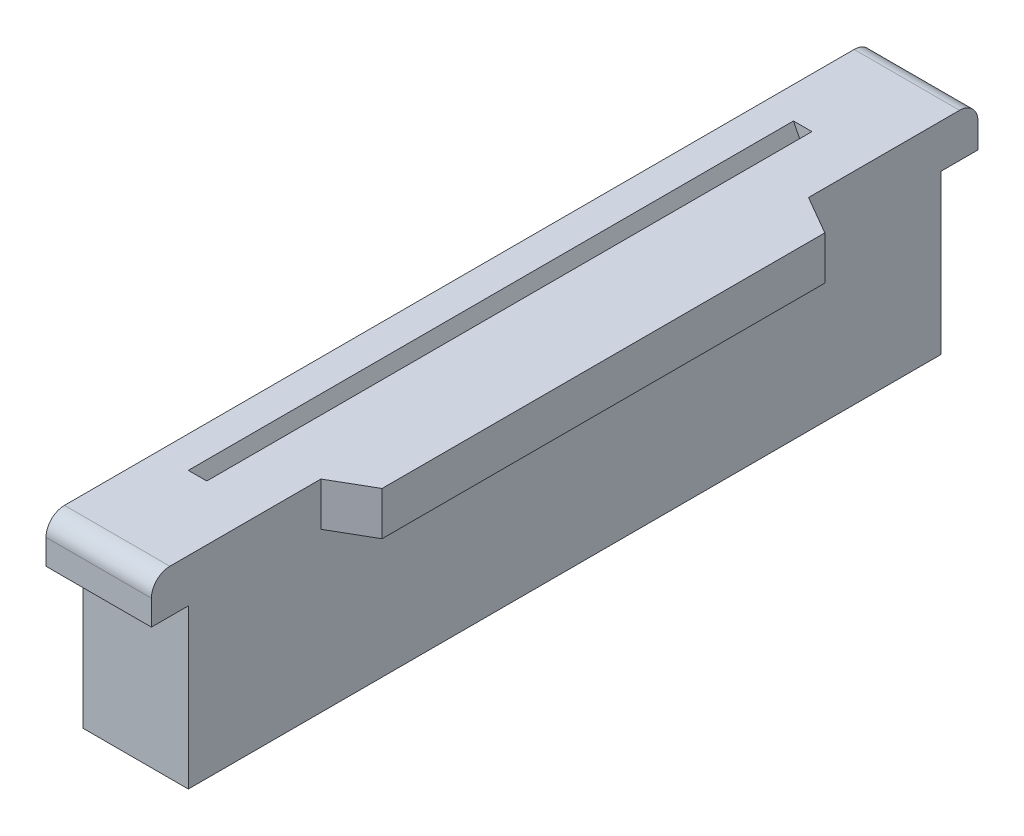
ISO-10303-21;
HEADER;
FILE_DESCRIPTION(('STEP AP214'),'2;1');
FILE_NAME('part.step','',(''),(''),'','','');
FILE_SCHEMA(('AUTOMOTIVE_DESIGN { 1 0 10303 214 1 1 1 1 }'));
ENDSEC;
DATA;
#1=APPLICATION_CONTEXT('core data for automotive mechanical design processes');
#2=APPLICATION_PROTOCOL_DEFINITION('international standard','automotive_design',2000,#1);
#3=PRODUCT_CONTEXT('',#1,'mechanical');
#4=PRODUCT('Part','Part','',(#3));
#5=PRODUCT_RELATED_PRODUCT_CATEGORY('part','',(#4));
#6=PRODUCT_DEFINITION_FORMATION('','',#4);
#7=PRODUCT_DEFINITION_CONTEXT('part definition',#1,'design');
#8=PRODUCT_DEFINITION('design','',#6,#7);
#9=PRODUCT_DEFINITION_SHAPE('','',#8);
#10=(LENGTH_UNIT() NAMED_UNIT(*) SI_UNIT(.MILLI.,.METRE.));
#11=(NAMED_UNIT(*) PLANE_ANGLE_UNIT() SI_UNIT($,.RADIAN.));
#12=(NAMED_UNIT(*) SI_UNIT($,.STERADIAN.) SOLID_ANGLE_UNIT());
#13=UNCERTAINTY_MEASURE_WITH_UNIT(LENGTH_MEASURE(1.E-05),#10,'distance_accuracy_value','');
#14=(GEOMETRIC_REPRESENTATION_CONTEXT(3) GLOBAL_UNCERTAINTY_ASSIGNED_CONTEXT((#13)) GLOBAL_UNIT_ASSIGNED_CONTEXT((#10,
#11,#12)) REPRESENTATION_CONTEXT('',''));
#15=CARTESIAN_POINT('',(0.,0.,0.));
#16=DIRECTION('',(0.,0.,1.));
#17=DIRECTION('',(1.,0.,0.));
#18=AXIS2_PLACEMENT_3D('',#15,#16,#17);
#19=CARTESIAN_POINT('',(3.25341354753561,-7.96661692123128,32.7500000000282));
#20=DIRECTION('',(0.,0.,1.));
#21=DIRECTION('',(1.,0.,0.));
#22=AXIS2_PLACEMENT_3D('',#19,#20,#21);
#23=PLANE('',#22);
#24=DIRECTION('',(0.,1.,0.));
#25=VECTOR('',#24,1.);
#26=CARTESIAN_POINT('',(1.29999999998284,-7.44999999998324,32.7500000000282));
#27=LINE('',#26,#25);
#28=CARTESIAN_POINT('',(1.29999999998286,-7.44999999998325,32.7500000000282));
#29=VERTEX_POINT('',#28);
#30=CARTESIAN_POINT('',(1.29999999998287,-3.14999999998325,32.7500000000282));
#31=VERTEX_POINT('',#30);
#32=EDGE_CURVE('E41',#29,#31,#27,.T.);
#33=ORIENTED_EDGE('',*,*,#32,.F.);
#34=DIRECTION('',(1.,0.,0.));
#35=VECTOR('',#34,1.);
#36=CARTESIAN_POINT('',(1.29999999998286,-7.44999999998324,32.7500000000282));
#37=LINE('',#36,#35);
#38=CARTESIAN_POINT('',(4.15682709508845,-7.44999999998325,32.7500000000282));
#39=VERTEX_POINT('',#38);
#40=EDGE_CURVE('E11',#29,#39,#37,.T.);
#41=ORIENTED_EDGE('',*,*,#40,.T.);
#42=DIRECTION('',(0.,-1.,0.));
#43=VECTOR('',#42,1.);
#44=CARTESIAN_POINT('',(4.15682709508845,-3.14999999998325,32.7500000000282));
#45=LINE('',#44,#43);
#46=CARTESIAN_POINT('',(4.15682709508847,-3.14999999998325,32.7500000000282));
#47=VERTEX_POINT('',#46);
#48=EDGE_CURVE('E220',#47,#39,#45,.T.);
#49=ORIENTED_EDGE('',*,*,#48,.F.);
#50=DIRECTION('',(1.,0.,0.));
#51=VECTOR('',#50,1.);
#52=CARTESIAN_POINT('',(1.29999999998287,-3.14999999998325,32.7500000000282));
#53=LINE('',#52,#51);
#54=EDGE_CURVE('E21',#31,#47,#53,.T.);
#55=ORIENTED_EDGE('',*,*,#54,.F.);
#56=EDGE_LOOP('',(#33,#41,#49,#55));
#57=FACE_BOUND('',#56,.T.);
#58=ADVANCED_FACE('F17',(#57),#23,.T.);
#59=CARTESIAN_POINT('',(1.29999999998286,-4.70999999998325,11.3500000000282));
#60=DIRECTION('',(-1.,0.,0.));
#61=DIRECTION('',(0.,0.,1.));
#62=AXIS2_PLACEMENT_3D('',#59,#60,#61);
#63=PLANE('',#62);
#64=CARTESIAN_POINT('',(1.29999999998286,-2.46999999998325,11.8500000000282));
#65=DIRECTION('',(1.,0.,0.));
#66=DIRECTION('',(0.,1.,0.));
#67=AXIS2_PLACEMENT_3D('',#64,#65,#66);
#68=CIRCLE('',#67,0.5);
#69=CARTESIAN_POINT('',(1.29999999998287,-2.46999999998325,11.3500000000282));
#70=VERTEX_POINT('',#69);
#71=CARTESIAN_POINT('',(1.29999999998286,-1.96999999998325,11.8500000000282));
#72=VERTEX_POINT('',#71);
#73=EDGE_CURVE('E235',#70,#72,#68,.T.);
#74=ORIENTED_EDGE('',*,*,#73,.F.);
#75=DIRECTION('',(0.,-1.,0.));
#76=VECTOR('',#75,1.);
#77=CARTESIAN_POINT('',(1.29999999998286,-2.46999999998325,11.3500000000282));
#78=LINE('',#77,#76);
#79=CARTESIAN_POINT('',(1.29999999998286,-3.14999999998325,11.3500000000282));
#80=VERTEX_POINT('',#79);
#81=EDGE_CURVE('E28',#70,#80,#78,.T.);
#82=ORIENTED_EDGE('',*,*,#81,.T.);
#83=DIRECTION('',(0.,0.,1.));
#84=VECTOR('',#83,1.);
#85=CARTESIAN_POINT('',(1.29999999998289,-3.14999999998325,11.3500000000282));
#86=LINE('',#85,#84);
#87=CARTESIAN_POINT('',(1.29999999998289,-3.14999999998325,12.3500000000282));
#88=VERTEX_POINT('',#87);
#89=EDGE_CURVE('E227',#80,#88,#86,.T.);
#90=ORIENTED_EDGE('',*,*,#89,.T.);
#91=DIRECTION('',(0.,-1.,0.));
#92=VECTOR('',#91,1.);
#93=CARTESIAN_POINT('',(1.29999999998286,-3.14999999998325,12.3500000000282));
#94=LINE('',#93,#92);
#95=CARTESIAN_POINT('',(1.29999999998286,-7.44999999998324,12.3500000000282));
#96=VERTEX_POINT('',#95);
#97=EDGE_CURVE('E224',#88,#96,#94,.T.);
#98=ORIENTED_EDGE('',*,*,#97,.T.);
#99=DIRECTION('',(0.,0.,1.));
#100=VECTOR('',#99,1.);
#101=CARTESIAN_POINT('',(1.29999999998286,-7.44999999998324,12.3500000000282));
#102=LINE('',#101,#100);
#103=EDGE_CURVE('E228',#96,#29,#102,.T.);
#104=ORIENTED_EDGE('',*,*,#103,.T.);
#105=ORIENTED_EDGE('',*,*,#32,.T.);
#106=DIRECTION('',(0.,0.,1.));
#107=VECTOR('',#106,1.);
#108=CARTESIAN_POINT('',(1.29999999998287,-3.14999999998325,32.7500000000282));
#109=LINE('',#108,#107);
#110=CARTESIAN_POINT('',(1.29999999998285,-3.14999999998325,33.7500000000282));
#111=VERTEX_POINT('',#110);
#112=EDGE_CURVE('E234',#31,#111,#109,.T.);
#113=ORIENTED_EDGE('',*,*,#112,.T.);
#114=DIRECTION('',(0.,-1.,0.));
#115=VECTOR('',#114,1.);
#116=CARTESIAN_POINT('',(1.29999999998284,-2.46999999998325,33.7500000000282));
#117=LINE('',#116,#115);
#118=CARTESIAN_POINT('',(1.29999999998285,-2.46999999998325,33.7500000000282));
#119=VERTEX_POINT('',#118);
#120=EDGE_CURVE('E265',#119,#111,#117,.T.);
#121=ORIENTED_EDGE('',*,*,#120,.F.);
#122=CARTESIAN_POINT('',(1.29999999998284,-2.46999999998326,33.2500000000282));
#123=DIRECTION('',(1.,0.,0.));
#124=DIRECTION('',(0.,0.,1.));
#125=AXIS2_PLACEMENT_3D('',#122,#123,#124);
#126=CIRCLE('',#125,0.500000000000007);
#127=CARTESIAN_POINT('',(1.29999999998285,-1.96999999998325,33.2500000000282));
#128=VERTEX_POINT('',#127);
#129=EDGE_CURVE('E196',#128,#119,#126,.T.);
#130=ORIENTED_EDGE('',*,*,#129,.F.);
#131=DIRECTION('',(0.,0.,1.));
#132=VECTOR('',#131,1.);
#133=CARTESIAN_POINT('',(1.29999999998286,-1.96999999998325,11.8500000000282));
#134=LINE('',#133,#132);
#135=EDGE_CURVE('E295',#72,#128,#134,.T.);
#136=ORIENTED_EDGE('',*,*,#135,.F.);
#137=EDGE_LOOP('',(#74,#82,#90,#98,#104,#105,#113,#121,#130,#136));
#138=FACE_BOUND('',#137,.T.);
#139=ADVANCED_FACE('F474',(#138),#63,.T.);
#140=CARTESIAN_POINT('',(2.72841354753565,-2.46999999998325,11.8500000000282));
#141=DIRECTION('',(1.,0.,0.));
#142=DIRECTION('',(0.,0.,-1.));
#143=AXIS2_PLACEMENT_3D('',#140,#141,#142);
#144=CYLINDRICAL_SURFACE('',#143,0.5);
#145=DIRECTION('',(-1.,0.,0.));
#146=VECTOR('',#145,1.);
#147=CARTESIAN_POINT('',(4.15682709508845,-2.46999999998325,11.3500000000282));
#148=LINE('',#147,#146);
#149=CARTESIAN_POINT('',(4.15682709508845,-2.46999999998325,11.3500000000282));
#150=VERTEX_POINT('',#149);
#151=EDGE_CURVE('E230',#150,#70,#148,.T.);
#152=ORIENTED_EDGE('',*,*,#151,.T.);
#153=ORIENTED_EDGE('',*,*,#73,.T.);
#154=DIRECTION('',(-1.,0.,0.));
#155=VECTOR('',#154,1.);
#156=CARTESIAN_POINT('',(4.15682709508843,-1.96999999998325,11.8500000000282));
#157=LINE('',#156,#155);
#158=CARTESIAN_POINT('',(4.15682709508844,-1.96999999998325,11.8500000000282));
#159=VERTEX_POINT('',#158);
#160=EDGE_CURVE('E290',#159,#72,#157,.T.);
#161=ORIENTED_EDGE('',*,*,#160,.F.);
#162=CARTESIAN_POINT('',(4.15682709508845,-2.46999999998325,11.8500000000282));
#163=DIRECTION('',(-1.,0.,0.));
#164=DIRECTION('',(0.,0.,-1.));
#165=AXIS2_PLACEMENT_3D('',#162,#163,#164);
#166=CIRCLE('',#165,0.5);
#167=EDGE_CURVE('E277',#159,#150,#166,.T.);
#168=ORIENTED_EDGE('',*,*,#167,.T.);
#169=EDGE_LOOP('',(#152,#153,#161,#168));
#170=FACE_BOUND('',#169,.T.);
#171=ADVANCED_FACE('F479',(#170),#144,.T.);
#172=CARTESIAN_POINT('',(-15.3004197519678,-1.96999999998325,22.5500000000282));
#173=DIRECTION('',(0.,1.,0.));
#174=DIRECTION('',(1.,0.,0.));
#175=AXIS2_PLACEMENT_3D('',#172,#173,#174);
#176=PLANE('',#175);
#177=DIRECTION('',(0.,0.,-1.));
#178=VECTOR('',#177,1.);
#179=CARTESIAN_POINT('',(5.20682709508844,-1.96999999998325,28.5500000000281));
#180=LINE('',#179,#178);
#181=CARTESIAN_POINT('',(5.20682709508844,-1.96999999998325,28.5500000000281));
#182=VERTEX_POINT('',#181);
#183=CARTESIAN_POINT('',(5.20682709508844,-1.96999999998325,16.5500000000282));
#184=VERTEX_POINT('',#183);
#185=EDGE_CURVE('E273',#182,#184,#180,.T.);
#186=ORIENTED_EDGE('',*,*,#185,.T.);
#187=DIRECTION('',(-0.866025403784439,0.,-0.5));
#188=VECTOR('',#187,1.);
#189=CARTESIAN_POINT('',(5.20682709508844,-1.96999999998325,16.5500000000282));
#190=LINE('',#189,#188);
#191=CARTESIAN_POINT('',(4.15682709508845,-1.96999999998325,15.9437822173791));
#192=VERTEX_POINT('',#191);
#193=EDGE_CURVE('E278',#184,#192,#190,.T.);
#194=ORIENTED_EDGE('',*,*,#193,.T.);
#195=DIRECTION('',(0.,0.,-1.));
#196=VECTOR('',#195,1.);
#197=CARTESIAN_POINT('',(4.15682709508845,-1.96999999998325,15.9437822173791));
#198=LINE('',#197,#196);
#199=EDGE_CURVE('E294',#192,#159,#198,.T.);
#200=ORIENTED_EDGE('',*,*,#199,.T.);
#201=ORIENTED_EDGE('',*,*,#160,.T.);
#202=ORIENTED_EDGE('',*,*,#135,.T.);
#203=DIRECTION('',(1.,0.,0.));
#204=VECTOR('',#203,1.);
#205=CARTESIAN_POINT('',(1.29999999998284,-1.96999999998325,33.2500000000282));
#206=LINE('',#205,#204);
#207=CARTESIAN_POINT('',(4.15682709508845,-1.96999999998325,33.2500000000282));
#208=VERTEX_POINT('',#207);
#209=EDGE_CURVE('E317',#128,#208,#206,.T.);
#210=ORIENTED_EDGE('',*,*,#209,.T.);
#211=DIRECTION('',(0.,0.,-1.));
#212=VECTOR('',#211,1.);
#213=CARTESIAN_POINT('',(4.15682709508845,-1.96999999998325,33.2500000000282));
#214=LINE('',#213,#212);
#215=CARTESIAN_POINT('',(4.15682709508845,-1.96999999998325,29.1562177826772));
#216=VERTEX_POINT('',#215);
#217=EDGE_CURVE('E190',#208,#216,#214,.T.);
#218=ORIENTED_EDGE('',*,*,#217,.T.);
#219=DIRECTION('',(0.866025403784439,0.,-0.5));
#220=VECTOR('',#219,1.);
#221=CARTESIAN_POINT('',(4.15682709508845,-1.96999999998325,29.1562177826772));
#222=LINE('',#221,#220);
#223=EDGE_CURVE('E308',#216,#182,#222,.T.);
#224=ORIENTED_EDGE('',*,*,#223,.T.);
#225=EDGE_LOOP('',(#186,#194,#200,#201,#202,#210,#218,#224));
#226=FACE_BOUND('',#225,.T.);
#227=DIRECTION('',(-1.,0.,0.));
#228=VECTOR('',#227,1.);
#229=CARTESIAN_POINT('',(2.65682709508845,-1.96999999998325,30.7500000000282));
#230=LINE('',#229,#228);
#231=CARTESIAN_POINT('',(2.65682709508845,-1.96999999998325,30.7500000000282));
#232=VERTEX_POINT('',#231);
#233=CARTESIAN_POINT('',(2.15682709508845,-1.96999999998325,30.7500000000282));
#234=VERTEX_POINT('',#233);
#235=EDGE_CURVE('E311',#232,#234,#230,.T.);
#236=ORIENTED_EDGE('',*,*,#235,.T.);
#237=DIRECTION('',(0.,0.,-1.));
#238=VECTOR('',#237,1.);
#239=CARTESIAN_POINT('',(2.15682709508845,-1.96999999998325,30.7500000000282));
#240=LINE('',#239,#238);
#241=CARTESIAN_POINT('',(2.15682709508845,-1.96999999998325,14.3500000000282));
#242=VERTEX_POINT('',#241);
#243=EDGE_CURVE('E157',#234,#242,#240,.T.);
#244=ORIENTED_EDGE('',*,*,#243,.T.);
#245=DIRECTION('',(1.,0.,0.));
#246=VECTOR('',#245,1.);
#247=CARTESIAN_POINT('',(2.15682709508845,-1.96999999998325,14.3500000000282));
#248=LINE('',#247,#246);
#249=CARTESIAN_POINT('',(2.65682709508845,-1.96999999998325,14.3500000000282));
#250=VERTEX_POINT('',#249);
#251=EDGE_CURVE('E146',#242,#250,#248,.T.);
#252=ORIENTED_EDGE('',*,*,#251,.T.);
#253=DIRECTION('',(0.,0.,1.));
#254=VECTOR('',#253,1.);
#255=CARTESIAN_POINT('',(2.65682709508845,-1.96999999998325,14.3500000000282));
#256=LINE('',#255,#254);
#257=EDGE_CURVE('E302',#250,#232,#256,.T.);
#258=ORIENTED_EDGE('',*,*,#257,.T.);
#259=EDGE_LOOP('',(#236,#244,#252,#258));
#260=FACE_BOUND('',#259,.T.);
#261=ADVANCED_FACE('F360',(#226,#260),#176,.T.);
#262=CARTESIAN_POINT('',(2.65682709508845,-4.70999999998325,30.7500000000282));
#263=DIRECTION('',(0.,0.,-1.));
#264=DIRECTION('',(0.,-1.,0.));
#265=AXIS2_PLACEMENT_3D('',#262,#263,#264);
#266=PLANE('',#265);
#267=DIRECTION('',(0.,-1.,0.));
#268=VECTOR('',#267,1.);
#269=CARTESIAN_POINT('',(2.65682709508845,-1.96999999998325,30.7500000000282));
#270=LINE('',#269,#268);
#271=CARTESIAN_POINT('',(2.65682709508845,-2.96999999998325,30.7500000000282));
#272=VERTEX_POINT('',#271);
#273=EDGE_CURVE('E298',#232,#272,#270,.T.);
#274=ORIENTED_EDGE('',*,*,#273,.T.);
#275=DIRECTION('',(-0.447213595499958,0.894427190999916,0.));
#276=VECTOR('',#275,1.);
#277=CARTESIAN_POINT('',(2.65682709508845,-2.96999999998325,30.7500000000282));
#278=LINE('',#277,#276);
#279=EDGE_CURVE('E271',#272,#234,#278,.T.);
#280=ORIENTED_EDGE('',*,*,#279,.T.);
#281=ORIENTED_EDGE('',*,*,#235,.F.);
#282=EDGE_LOOP('',(#274,#280,#281));
#283=FACE_BOUND('',#282,.T.);
#284=ADVANCED_FACE('F368',(#283),#266,.T.);
#285=CARTESIAN_POINT('',(2.65682709508845,-4.70999999998325,14.3500000000282));
#286=DIRECTION('',(-1.,0.,0.));
#287=DIRECTION('',(0.,0.,1.));
#288=AXIS2_PLACEMENT_3D('',#285,#286,#287);
#289=PLANE('',#288);
#290=DIRECTION('',(0.,0.,-1.));
#291=VECTOR('',#290,1.);
#292=CARTESIAN_POINT('',(2.65682709508845,-2.96999999998325,30.7500000000282));
#293=LINE('',#292,#291);
#294=CARTESIAN_POINT('',(2.65682709508845,-2.96999999998325,14.3500000000282));
#295=VERTEX_POINT('',#294);
#296=EDGE_CURVE('E272',#272,#295,#293,.T.);
#297=ORIENTED_EDGE('',*,*,#296,.F.);
#298=ORIENTED_EDGE('',*,*,#273,.F.);
#299=ORIENTED_EDGE('',*,*,#257,.F.);
#300=DIRECTION('',(0.,-1.,0.));
#301=VECTOR('',#300,1.);
#302=CARTESIAN_POINT('',(2.65682709508845,-1.96999999998325,14.3500000000282));
#303=LINE('',#302,#301);
#304=EDGE_CURVE('E267',#250,#295,#303,.T.);
#305=ORIENTED_EDGE('',*,*,#304,.T.);
#306=EDGE_LOOP('',(#297,#298,#299,#305));
#307=FACE_BOUND('',#306,.T.);
#308=ADVANCED_FACE('F364',(#307),#289,.T.);
#309=CARTESIAN_POINT('',(1.29999999998286,-4.70999999998325,14.3500000000282));
#310=DIRECTION('',(0.,0.,1.));
#311=DIRECTION('',(1.,0.,0.));
#312=AXIS2_PLACEMENT_3D('',#309,#310,#311);
#313=PLANE('',#312);
#314=ORIENTED_EDGE('',*,*,#251,.F.);
#315=DIRECTION('',(-0.447213595499958,0.894427190999916,0.));
#316=VECTOR('',#315,1.);
#317=CARTESIAN_POINT('',(2.65682709508845,-2.96999999998325,14.3500000000282));
#318=LINE('',#317,#316);
#319=EDGE_CURVE('E284',#295,#242,#318,.T.);
#320=ORIENTED_EDGE('',*,*,#319,.F.);
#321=ORIENTED_EDGE('',*,*,#304,.F.);
#322=EDGE_LOOP('',(#314,#320,#321));
#323=FACE_BOUND('',#322,.T.);
#324=ADVANCED_FACE('F19',(#323),#313,.T.);
#325=CARTESIAN_POINT('',(2.65682709508845,-2.96999999998325,22.5500000000282));
#326=DIRECTION('',(0.894427190999916,0.447213595499958,0.));
#327=DIRECTION('',(0.,0.,-1.));
#328=AXIS2_PLACEMENT_3D('',#325,#326,#327);
#329=PLANE('',#328);
#330=ORIENTED_EDGE('',*,*,#296,.T.);
#331=ORIENTED_EDGE('',*,*,#319,.T.);
#332=ORIENTED_EDGE('',*,*,#243,.F.);
#333=ORIENTED_EDGE('',*,*,#279,.F.);
#334=EDGE_LOOP('',(#330,#331,#332,#333));
#335=FACE_BOUND('',#334,.T.);
#336=ADVANCED_FACE('F437',(#335),#329,.T.);
#337=CARTESIAN_POINT('',(5.20682709508844,-4.70999999998325,28.5500000000281));
#338=DIRECTION('',(1.,0.,0.));
#339=DIRECTION('',(0.,1.,0.));
#340=AXIS2_PLACEMENT_3D('',#337,#338,#339);
#341=PLANE('',#340);
#342=DIRECTION('',(0.,0.,-1.));
#343=VECTOR('',#342,1.);
#344=CARTESIAN_POINT('',(5.20682709508844,-3.14999999998325,28.5500000000281));
#345=LINE('',#344,#343);
#346=CARTESIAN_POINT('',(5.20682709508844,-3.14999999998325,28.5500000000281));
#347=VERTEX_POINT('',#346);
#348=CARTESIAN_POINT('',(5.20682709508845,-3.14999999998325,16.5500000000282));
#349=VERTEX_POINT('',#348);
#350=EDGE_CURVE('E244',#347,#349,#345,.T.);
#351=ORIENTED_EDGE('',*,*,#350,.T.);
#352=DIRECTION('',(0.,-1.,0.));
#353=VECTOR('',#352,1.);
#354=CARTESIAN_POINT('',(5.20682709508844,-1.96999999998325,16.5500000000282));
#355=LINE('',#354,#353);
#356=EDGE_CURVE('E204',#184,#349,#355,.T.);
#357=ORIENTED_EDGE('',*,*,#356,.F.);
#358=ORIENTED_EDGE('',*,*,#185,.F.);
#359=DIRECTION('',(0.,-1.,0.));
#360=VECTOR('',#359,1.);
#361=CARTESIAN_POINT('',(5.20682709508844,-1.96999999998325,28.5500000000281));
#362=LINE('',#361,#360);
#363=EDGE_CURVE('E242',#182,#347,#362,.T.);
#364=ORIENTED_EDGE('',*,*,#363,.T.);
#365=EDGE_LOOP('',(#351,#357,#358,#364));
#366=FACE_BOUND('',#365,.T.);
#367=ADVANCED_FACE('F442',(#366),#341,.T.);
#368=CARTESIAN_POINT('',(4.15682709508845,-3.14999999998325,22.5500000000282));
#369=DIRECTION('',(0.,-1.,0.));
#370=DIRECTION('',(0.,0.,-1.));
#371=AXIS2_PLACEMENT_3D('',#368,#369,#370);
#372=PLANE('',#371);
#373=DIRECTION('',(-0.866025403784439,0.,-0.5));
#374=VECTOR('',#373,1.);
#375=CARTESIAN_POINT('',(5.20682709508844,-3.14999999998325,16.5500000000282));
#376=LINE('',#375,#374);
#377=CARTESIAN_POINT('',(4.15682709508845,-3.14999999998325,15.9437822173791));
#378=VERTEX_POINT('',#377);
#379=EDGE_CURVE('E241',#349,#378,#376,.T.);
#380=ORIENTED_EDGE('',*,*,#379,.F.);
#381=ORIENTED_EDGE('',*,*,#350,.F.);
#382=DIRECTION('',(0.866025403784439,0.,-0.5));
#383=VECTOR('',#382,1.);
#384=CARTESIAN_POINT('',(4.15682709508845,-3.14999999998325,29.1562177826772));
#385=LINE('',#384,#383);
#386=CARTESIAN_POINT('',(4.15682709508845,-3.14999999998325,29.1562177826772));
#387=VERTEX_POINT('',#386);
#388=EDGE_CURVE('E240',#387,#347,#385,.T.);
#389=ORIENTED_EDGE('',*,*,#388,.F.);
#390=DIRECTION('',(0.,0.,-1.));
#391=VECTOR('',#390,1.);
#392=CARTESIAN_POINT('',(4.15682709508845,-3.14999999998325,29.1562177826772));
#393=LINE('',#392,#391);
#394=EDGE_CURVE('E245',#387,#378,#393,.T.);
#395=ORIENTED_EDGE('',*,*,#394,.T.);
#396=EDGE_LOOP('',(#380,#381,#389,#395));
#397=FACE_BOUND('',#396,.T.);
#398=ADVANCED_FACE('F468',(#397),#372,.T.);
#399=CARTESIAN_POINT('',(4.15682709508845,-4.70999999998325,29.1562177826772));
#400=DIRECTION('',(0.5,0.,0.866025403784439));
#401=DIRECTION('',(0.,-1.,0.));
#402=AXIS2_PLACEMENT_3D('',#399,#400,#401);
#403=PLANE('',#402);
#404=ORIENTED_EDGE('',*,*,#388,.T.);
#405=ORIENTED_EDGE('',*,*,#363,.F.);
#406=ORIENTED_EDGE('',*,*,#223,.F.);
#407=DIRECTION('',(0.,-1.,0.));
#408=VECTOR('',#407,1.);
#409=CARTESIAN_POINT('',(4.15682709508845,-1.96999999998325,29.1562177826772));
#410=LINE('',#409,#408);
#411=EDGE_CURVE('E236',#216,#387,#410,.T.);
#412=ORIENTED_EDGE('',*,*,#411,.T.);
#413=EDGE_LOOP('',(#404,#405,#406,#412));
#414=FACE_BOUND('',#413,.T.);
#415=ADVANCED_FACE('F497',(#414),#403,.T.);
#416=CARTESIAN_POINT('',(5.20682709508844,-4.70999999998325,16.5500000000282));
#417=DIRECTION('',(0.499999999999992,0.,-0.866025403784443));
#418=DIRECTION('',(0.,-1.,0.));
#419=AXIS2_PLACEMENT_3D('',#416,#417,#418);
#420=PLANE('',#419);
#421=ORIENTED_EDGE('',*,*,#379,.T.);
#422=DIRECTION('',(0.,-1.,0.));
#423=VECTOR('',#422,1.);
#424=CARTESIAN_POINT('',(4.15682709508845,-1.96999999998325,15.9437822173791));
#425=LINE('',#424,#423);
#426=EDGE_CURVE('E211',#192,#378,#425,.T.);
#427=ORIENTED_EDGE('',*,*,#426,.F.);
#428=ORIENTED_EDGE('',*,*,#193,.F.);
#429=ORIENTED_EDGE('',*,*,#356,.T.);
#430=EDGE_LOOP('',(#421,#427,#428,#429));
#431=FACE_BOUND('',#430,.T.);
#432=ADVANCED_FACE('F492',(#431),#420,.T.);
#433=CARTESIAN_POINT('',(2.72841354753564,-2.46999999998325,33.2500000000282));
#434=DIRECTION('',(-1.,0.,0.));
#435=DIRECTION('',(0.,0.,1.));
#436=AXIS2_PLACEMENT_3D('',#433,#434,#435);
#437=CYLINDRICAL_SURFACE('',#436,0.5);
#438=DIRECTION('',(1.,0.,0.));
#439=VECTOR('',#438,1.);
#440=CARTESIAN_POINT('',(1.29999999998286,-2.46999999998325,33.7500000000282));
#441=LINE('',#440,#439);
#442=CARTESIAN_POINT('',(4.15682709508845,-2.46999999998325,33.7500000000282));
#443=VERTEX_POINT('',#442);
#444=EDGE_CURVE('E195',#119,#443,#441,.T.);
#445=ORIENTED_EDGE('',*,*,#444,.T.);
#446=CARTESIAN_POINT('',(4.15682709508845,-2.46999999998326,33.2500000000282));
#447=DIRECTION('',(-1.,0.,0.));
#448=DIRECTION('',(0.,1.,0.));
#449=AXIS2_PLACEMENT_3D('',#446,#447,#448);
#450=CIRCLE('',#449,0.500000000000007);
#451=EDGE_CURVE('E184',#443,#208,#450,.T.);
#452=ORIENTED_EDGE('',*,*,#451,.T.);
#453=ORIENTED_EDGE('',*,*,#209,.F.);
#454=ORIENTED_EDGE('',*,*,#129,.T.);
#455=EDGE_LOOP('',(#445,#452,#453,#454));
#456=FACE_BOUND('',#455,.T.);
#457=ADVANCED_FACE('F200',(#456),#437,.T.);
#458=CARTESIAN_POINT('',(1.29999999998284,-4.70999999998325,33.7500000000282));
#459=DIRECTION('',(0.,0.,1.));
#460=DIRECTION('',(1.,0.,0.));
#461=AXIS2_PLACEMENT_3D('',#458,#459,#460);
#462=PLANE('',#461);
#463=ORIENTED_EDGE('',*,*,#444,.F.);
#464=ORIENTED_EDGE('',*,*,#120,.T.);
#465=DIRECTION('',(1.,0.,0.));
#466=VECTOR('',#465,1.);
#467=CARTESIAN_POINT('',(1.29999999998284,-3.14999999998325,33.7500000000282));
#468=LINE('',#467,#466);
#469=CARTESIAN_POINT('',(4.15682709508844,-3.14999999998325,33.7500000000282));
#470=VERTEX_POINT('',#469);
#471=EDGE_CURVE('E208',#111,#470,#468,.T.);
#472=ORIENTED_EDGE('',*,*,#471,.T.);
#473=DIRECTION('',(0.,-1.,0.));
#474=VECTOR('',#473,1.);
#475=CARTESIAN_POINT('',(4.15682709508843,-2.46999999998325,33.7500000000282));
#476=LINE('',#475,#474);
#477=EDGE_CURVE('E180',#443,#470,#476,.T.);
#478=ORIENTED_EDGE('',*,*,#477,.F.);
#479=EDGE_LOOP('',(#463,#464,#472,#478));
#480=FACE_BOUND('',#479,.T.);
#481=ADVANCED_FACE('F206',(#480),#462,.T.);
#482=CARTESIAN_POINT('',(3.25341354753561,-7.96661692123128,12.3500000000282));
#483=DIRECTION('',(0.,0.,-1.));
#484=DIRECTION('',(0.,-1.,0.));
#485=AXIS2_PLACEMENT_3D('',#482,#483,#484);
#486=PLANE('',#485);
#487=ORIENTED_EDGE('',*,*,#97,.F.);
#488=DIRECTION('',(-1.,0.,0.));
#489=VECTOR('',#488,1.);
#490=CARTESIAN_POINT('',(4.15682709508846,-3.14999999998325,12.3500000000282));
#491=LINE('',#490,#489);
#492=CARTESIAN_POINT('',(4.15682709508847,-3.14999999998325,12.3500000000282));
#493=VERTEX_POINT('',#492);
#494=EDGE_CURVE('E325',#493,#88,#491,.T.);
#495=ORIENTED_EDGE('',*,*,#494,.F.);
#496=DIRECTION('',(0.,1.,0.));
#497=VECTOR('',#496,1.);
#498=CARTESIAN_POINT('',(4.15682709508845,-7.44999999998324,12.3500000000282));
#499=LINE('',#498,#497);
#500=CARTESIAN_POINT('',(4.15682709508845,-7.44999999998324,12.3500000000282));
#501=VERTEX_POINT('',#500);
#502=EDGE_CURVE('E114',#501,#493,#499,.T.);
#503=ORIENTED_EDGE('',*,*,#502,.F.);
#504=DIRECTION('',(-1.,0.,0.));
#505=VECTOR('',#504,1.);
#506=CARTESIAN_POINT('',(4.15682709508845,-7.44999999998324,12.3500000000282));
#507=LINE('',#506,#505);
#508=EDGE_CURVE('E266',#501,#96,#507,.T.);
#509=ORIENTED_EDGE('',*,*,#508,.T.);
#510=EDGE_LOOP('',(#487,#495,#503,#509));
#511=FACE_BOUND('',#510,.T.);
#512=ADVANCED_FACE('F504',(#511),#486,.T.);
#513=CARTESIAN_POINT('',(3.25341354753561,-3.14999999998325,12.3500000000282));
#514=DIRECTION('',(0.,-1.,0.));
#515=DIRECTION('',(0.,0.,-1.));
#516=AXIS2_PLACEMENT_3D('',#513,#514,#515);
#517=PLANE('',#516);
#518=ORIENTED_EDGE('',*,*,#89,.F.);
#519=DIRECTION('',(-1.,0.,0.));
#520=VECTOR('',#519,1.);
#521=CARTESIAN_POINT('',(4.15682709508845,-3.14999999998325,11.3500000000282));
#522=LINE('',#521,#520);
#523=CARTESIAN_POINT('',(4.15682709508845,-3.14999999998325,11.3500000000282));
#524=VERTEX_POINT('',#523);
#525=EDGE_CURVE('E303',#524,#80,#522,.T.);
#526=ORIENTED_EDGE('',*,*,#525,.F.);
#527=DIRECTION('',(0.,0.,-1.));
#528=VECTOR('',#527,1.);
#529=CARTESIAN_POINT('',(4.15682709508846,-3.14999999998325,12.3500000000282));
#530=LINE('',#529,#528);
#531=EDGE_CURVE('E128',#493,#524,#530,.T.);
#532=ORIENTED_EDGE('',*,*,#531,.F.);
#533=ORIENTED_EDGE('',*,*,#494,.T.);
#534=EDGE_LOOP('',(#518,#526,#532,#533));
#535=FACE_BOUND('',#534,.T.);
#536=ADVANCED_FACE('F459',(#535),#517,.T.);
#537=CARTESIAN_POINT('',(4.15682709508845,-4.70999999998325,11.3500000000282));
#538=DIRECTION('',(0.,0.,-1.));
#539=DIRECTION('',(0.,-1.,0.));
#540=AXIS2_PLACEMENT_3D('',#537,#538,#539);
#541=PLANE('',#540);
#542=ORIENTED_EDGE('',*,*,#151,.F.);
#543=DIRECTION('',(0.,-1.,0.));
#544=VECTOR('',#543,1.);
#545=CARTESIAN_POINT('',(4.15682709508845,-2.46999999998325,11.3500000000282));
#546=LINE('',#545,#544);
#547=EDGE_CURVE('E307',#150,#524,#546,.T.);
#548=ORIENTED_EDGE('',*,*,#547,.T.);
#549=ORIENTED_EDGE('',*,*,#525,.T.);
#550=ORIENTED_EDGE('',*,*,#81,.F.);
#551=EDGE_LOOP('',(#542,#548,#549,#550));
#552=FACE_BOUND('',#551,.T.);
#553=ADVANCED_FACE('F430',(#552),#541,.T.);
#554=CARTESIAN_POINT('',(3.25341354753561,-3.14999999998325,32.7500000000282));
#555=DIRECTION('',(0.,-1.,0.));
#556=DIRECTION('',(0.,0.,-1.));
#557=AXIS2_PLACEMENT_3D('',#554,#555,#556);
#558=PLANE('',#557);
#559=ORIENTED_EDGE('',*,*,#471,.F.);
#560=ORIENTED_EDGE('',*,*,#112,.F.);
#561=ORIENTED_EDGE('',*,*,#54,.T.);
#562=DIRECTION('',(0.,0.,-1.));
#563=VECTOR('',#562,1.);
#564=CARTESIAN_POINT('',(4.15682709508847,-3.14999999998325,33.7500000000282));
#565=LINE('',#564,#563);
#566=EDGE_CURVE('E212',#470,#47,#565,.T.);
#567=ORIENTED_EDGE('',*,*,#566,.F.);
#568=EDGE_LOOP('',(#559,#560,#561,#567));
#569=FACE_BOUND('',#568,.T.);
#570=ADVANCED_FACE('F425',(#569),#558,.T.);
#571=CARTESIAN_POINT('',(4.15682709508845,-4.89630399664546,35.9900000000282));
#572=DIRECTION('',(1.,0.,0.));
#573=DIRECTION('',(0.,1.,0.));
#574=AXIS2_PLACEMENT_3D('',#571,#572,#573);
#575=PLANE('',#574);
#576=ORIENTED_EDGE('',*,*,#426,.T.);
#577=ORIENTED_EDGE('',*,*,#394,.F.);
#578=ORIENTED_EDGE('',*,*,#411,.F.);
#579=ORIENTED_EDGE('',*,*,#217,.F.);
#580=ORIENTED_EDGE('',*,*,#451,.F.);
#581=ORIENTED_EDGE('',*,*,#477,.T.);
#582=ORIENTED_EDGE('',*,*,#566,.T.);
#583=ORIENTED_EDGE('',*,*,#48,.T.);
#584=DIRECTION('',(0.,0.,-1.));
#585=VECTOR('',#584,1.);
#586=CARTESIAN_POINT('',(4.15682709508845,-7.44999999998324,32.7500000000282));
#587=LINE('',#586,#585);
#588=EDGE_CURVE('E280',#39,#501,#587,.T.);
#589=ORIENTED_EDGE('',*,*,#588,.T.);
#590=ORIENTED_EDGE('',*,*,#502,.T.);
#591=ORIENTED_EDGE('',*,*,#531,.T.);
#592=ORIENTED_EDGE('',*,*,#547,.F.);
#593=ORIENTED_EDGE('',*,*,#167,.F.);
#594=ORIENTED_EDGE('',*,*,#199,.F.);
#595=EDGE_LOOP('',(#576,#577,#578,#579,#580,#581,#582,#583,#589,#590,#591,#592,#593,#594));
#596=FACE_BOUND('',#595,.T.);
#597=ADVANCED_FACE('F187',(#596),#575,.T.);
#598=CARTESIAN_POINT('',(3.08885323039752,-7.44999999998324,11.3500000000282));
#599=DIRECTION('',(0.,-1.,0.));
#600=DIRECTION('',(0.,0.,-1.));
#601=AXIS2_PLACEMENT_3D('',#598,#599,#600);
#602=PLANE('',#601);
#603=ORIENTED_EDGE('',*,*,#103,.F.);
#604=ORIENTED_EDGE('',*,*,#508,.F.);
#605=ORIENTED_EDGE('',*,*,#588,.F.);
#606=ORIENTED_EDGE('',*,*,#40,.F.);
#607=EDGE_LOOP('',(#603,#604,#605,#606));
#608=FACE_BOUND('',#607,.T.);
#609=ADVANCED_FACE('F451',(#608),#602,.T.);
#610=CLOSED_SHELL('',(#58,#139,#171,#261,#284,#308,#324,#336,#367,#398,#415,#432,#457,#481,#512,
#536,#553,#570,#597,#609));
#611=MANIFOLD_SOLID_BREP('B1',#610);
#612=ADVANCED_BREP_SHAPE_REPRESENTATION('',(#18,#611),#14);
#613=SHAPE_DEFINITION_REPRESENTATION(#9,#612);
ENDSEC;
END-ISO-10303-21;
